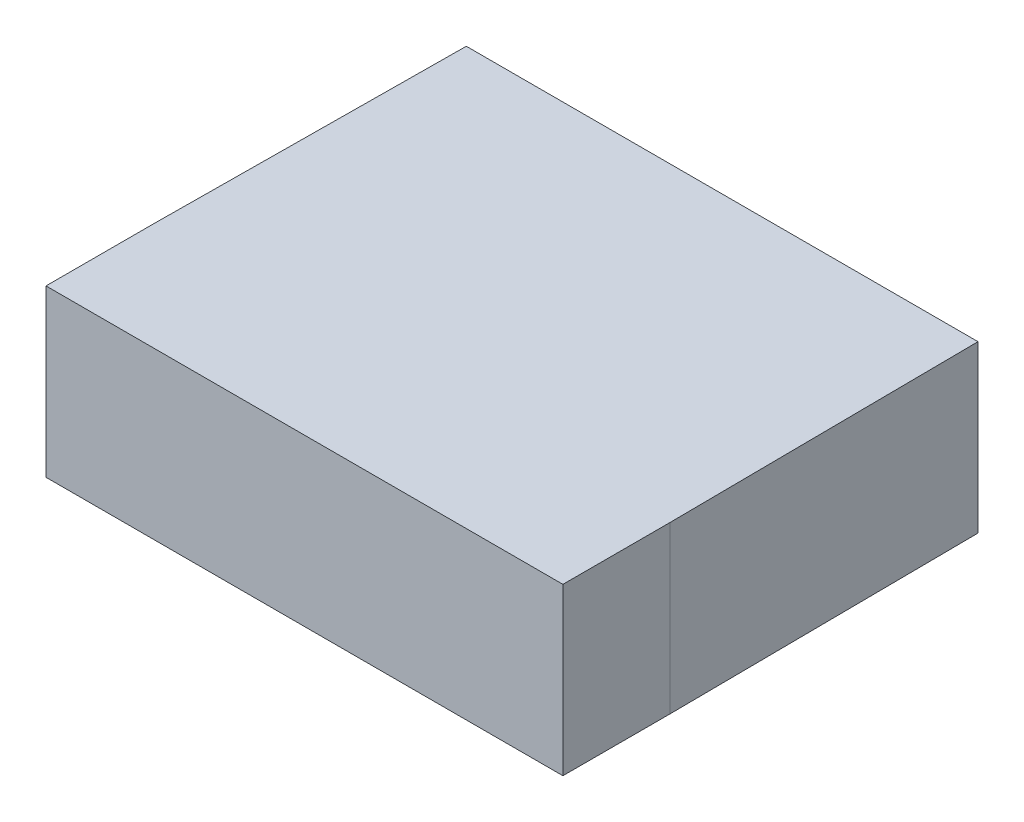
ISO-10303-21;
HEADER;
FILE_DESCRIPTION(('STEP AP214'),'2;1');
FILE_NAME('part.step','',(''),(''),'','','');
FILE_SCHEMA(('AUTOMOTIVE_DESIGN { 1 0 10303 214 1 1 1 1 }'));
ENDSEC;
DATA;
#1=APPLICATION_CONTEXT('core data for automotive mechanical design processes');
#2=APPLICATION_PROTOCOL_DEFINITION('international standard','automotive_design',2000,#1);
#3=PRODUCT_CONTEXT('',#1,'mechanical');
#4=PRODUCT('Part','Part','',(#3));
#5=PRODUCT_RELATED_PRODUCT_CATEGORY('part','',(#4));
#6=PRODUCT_DEFINITION_FORMATION('','',#4);
#7=PRODUCT_DEFINITION_CONTEXT('part definition',#1,'design');
#8=PRODUCT_DEFINITION('design','',#6,#7);
#9=PRODUCT_DEFINITION_SHAPE('','',#8);
#10=(LENGTH_UNIT() NAMED_UNIT(*) SI_UNIT(.MILLI.,.METRE.));
#11=(NAMED_UNIT(*) PLANE_ANGLE_UNIT() SI_UNIT($,.RADIAN.));
#12=(NAMED_UNIT(*) SI_UNIT($,.STERADIAN.) SOLID_ANGLE_UNIT());
#13=UNCERTAINTY_MEASURE_WITH_UNIT(LENGTH_MEASURE(1.E-05),#10,'distance_accuracy_value','');
#14=(GEOMETRIC_REPRESENTATION_CONTEXT(3) GLOBAL_UNCERTAINTY_ASSIGNED_CONTEXT((#13)) GLOBAL_UNIT_ASSIGNED_CONTEXT((#10,
#11,#12)) REPRESENTATION_CONTEXT('',''));
#15=CARTESIAN_POINT('',(0.,0.,0.));
#16=DIRECTION('',(0.,0.,1.));
#17=DIRECTION('',(1.,0.,0.));
#18=AXIS2_PLACEMENT_3D('',#15,#16,#17);
#19=CARTESIAN_POINT('',(-4.95,3.175,5.94999999999999));
#20=DIRECTION('',(0.999964693628953,0.,0.0084030646523441));
#21=DIRECTION('',(0.0084030646523441,0.,-0.999964693628953));
#22=AXIS2_PLACEMENT_3D('',#19,#20,#21);
#23=PLANE('',#22);
#24=DIRECTION('',(-0.0084030646523441,0.,0.999964693628953));
#25=VECTOR('',#24,1.);
#26=CARTESIAN_POINT('',(-4.95,0.,5.94999999999999));
#27=LINE('',#26,#25);
#28=CARTESIAN_POINT('',(-4.9,0.,0.));
#29=VERTEX_POINT('',#28);
#30=CARTESIAN_POINT('',(-4.95,0.,5.94999999999999));
#31=VERTEX_POINT('',#30);
#32=EDGE_CURVE('E118',#29,#31,#27,.T.);
#33=ORIENTED_EDGE('',*,*,#32,.T.);
#34=DIRECTION('',(0.,-1.,0.));
#35=VECTOR('',#34,1.);
#36=CARTESIAN_POINT('',(-4.95,3.175,5.94999999999999));
#37=LINE('',#36,#35);
#38=CARTESIAN_POINT('',(-4.95,3.175,5.94999999999999));
#39=VERTEX_POINT('',#38);
#40=EDGE_CURVE('E11',#39,#31,#37,.T.);
#41=ORIENTED_EDGE('',*,*,#40,.F.);
#42=DIRECTION('',(-0.0084030646523441,0.,0.999964693628953));
#43=VECTOR('',#42,1.);
#44=CARTESIAN_POINT('',(-4.95,3.175,5.94999999999999));
#45=LINE('',#44,#43);
#46=CARTESIAN_POINT('',(-4.9,3.175,0.));
#47=VERTEX_POINT('',#46);
#48=EDGE_CURVE('E128',#47,#39,#45,.T.);
#49=ORIENTED_EDGE('',*,*,#48,.F.);
#50=DIRECTION('',(0.,-1.,0.));
#51=VECTOR('',#50,1.);
#52=CARTESIAN_POINT('',(-4.9,3.175,0.));
#53=LINE('',#52,#51);
#54=EDGE_CURVE('E114',#47,#29,#53,.T.);
#55=ORIENTED_EDGE('',*,*,#54,.T.);
#56=EDGE_LOOP('',(#33,#41,#49,#55));
#57=FACE_BOUND('',#56,.T.);
#58=ADVANCED_FACE('F34',(#57),#23,.F.);
#59=CARTESIAN_POINT('',(-4.95,3.175,7.99999999999999));
#60=DIRECTION('',(0.999999999999999,0.,0.));
#61=DIRECTION('',(0.,0.,-0.999999999999999));
#62=AXIS2_PLACEMENT_3D('',#59,#60,#61);
#63=PLANE('',#62);
#64=DIRECTION('',(0.,0.,0.999999999999999));
#65=VECTOR('',#64,1.);
#66=CARTESIAN_POINT('',(-4.95,0.,7.99999999999999));
#67=LINE('',#66,#65);
#68=CARTESIAN_POINT('',(-4.95,0.,7.99999999999999));
#69=VERTEX_POINT('',#68);
#70=EDGE_CURVE('E121',#31,#69,#67,.T.);
#71=ORIENTED_EDGE('',*,*,#70,.T.);
#72=DIRECTION('',(0.,-1.,0.));
#73=VECTOR('',#72,1.);
#74=CARTESIAN_POINT('',(-4.95,3.175,7.99999999999999));
#75=LINE('',#74,#73);
#76=CARTESIAN_POINT('',(-4.95,3.175,7.99999999999999));
#77=VERTEX_POINT('',#76);
#78=EDGE_CURVE('E42',#77,#69,#75,.T.);
#79=ORIENTED_EDGE('',*,*,#78,.F.);
#80=DIRECTION('',(0.,0.,0.999999999999999));
#81=VECTOR('',#80,1.);
#82=CARTESIAN_POINT('',(-4.95,3.175,7.99999999999999));
#83=LINE('',#82,#81);
#84=EDGE_CURVE('E87',#39,#77,#83,.T.);
#85=ORIENTED_EDGE('',*,*,#84,.F.);
#86=ORIENTED_EDGE('',*,*,#40,.T.);
#87=EDGE_LOOP('',(#71,#79,#85,#86));
#88=FACE_BOUND('',#87,.T.);
#89=ADVANCED_FACE('F152',(#88),#63,.F.);
#90=CARTESIAN_POINT('',(4.94999999999999,3.175,7.99999999999999));
#91=DIRECTION('',(0.,0.,-0.999999999999999));
#92=DIRECTION('',(-0.999999999999999,0.,0.));
#93=AXIS2_PLACEMENT_3D('',#90,#91,#92);
#94=PLANE('',#93);
#95=DIRECTION('',(0.999999999999999,0.,0.));
#96=VECTOR('',#95,1.);
#97=CARTESIAN_POINT('',(4.94999999999999,0.,7.99999999999999));
#98=LINE('',#97,#96);
#99=CARTESIAN_POINT('',(4.94999999999999,0.,7.99999999999999));
#100=VERTEX_POINT('',#99);
#101=EDGE_CURVE('E123',#69,#100,#98,.T.);
#102=ORIENTED_EDGE('',*,*,#101,.T.);
#103=DIRECTION('',(0.,-1.,0.));
#104=VECTOR('',#103,1.);
#105=CARTESIAN_POINT('',(4.94999999999999,3.175,7.99999999999999));
#106=LINE('',#105,#104);
#107=CARTESIAN_POINT('',(4.94999999999999,3.175,7.99999999999999));
#108=VERTEX_POINT('',#107);
#109=EDGE_CURVE('E109',#108,#100,#106,.T.);
#110=ORIENTED_EDGE('',*,*,#109,.F.);
#111=DIRECTION('',(0.999999999999999,0.,0.));
#112=VECTOR('',#111,1.);
#113=CARTESIAN_POINT('',(4.94999999999999,3.175,7.99999999999999));
#114=LINE('',#113,#112);
#115=EDGE_CURVE('E100',#77,#108,#114,.T.);
#116=ORIENTED_EDGE('',*,*,#115,.F.);
#117=ORIENTED_EDGE('',*,*,#78,.T.);
#118=EDGE_LOOP('',(#102,#110,#116,#117));
#119=FACE_BOUND('',#118,.T.);
#120=ADVANCED_FACE('F134',(#119),#94,.F.);
#121=CARTESIAN_POINT('',(4.95,3.175,5.94999999999999));
#122=DIRECTION('',(-0.999999999999999,0.,0.));
#123=DIRECTION('',(0.,0.,0.999999999999999));
#124=AXIS2_PLACEMENT_3D('',#121,#122,#123);
#125=PLANE('',#124);
#126=DIRECTION('',(0.,0.,-0.999999999999999));
#127=VECTOR('',#126,1.);
#128=CARTESIAN_POINT('',(4.95,0.,5.94999999999999));
#129=LINE('',#128,#127);
#130=CARTESIAN_POINT('',(4.95,0.,5.94999999999999));
#131=VERTEX_POINT('',#130);
#132=EDGE_CURVE('E108',#100,#131,#129,.T.);
#133=ORIENTED_EDGE('',*,*,#132,.T.);
#134=DIRECTION('',(0.,-1.,0.));
#135=VECTOR('',#134,1.);
#136=CARTESIAN_POINT('',(4.95,3.175,5.94999999999999));
#137=LINE('',#136,#135);
#138=CARTESIAN_POINT('',(4.95,3.175,5.94999999999999));
#139=VERTEX_POINT('',#138);
#140=EDGE_CURVE('E105',#139,#131,#137,.T.);
#141=ORIENTED_EDGE('',*,*,#140,.F.);
#142=DIRECTION('',(0.,0.,-0.999999999999999));
#143=VECTOR('',#142,1.);
#144=CARTESIAN_POINT('',(4.95,3.175,5.94999999999999));
#145=LINE('',#144,#143);
#146=EDGE_CURVE('E94',#108,#139,#145,.T.);
#147=ORIENTED_EDGE('',*,*,#146,.F.);
#148=ORIENTED_EDGE('',*,*,#109,.T.);
#149=EDGE_LOOP('',(#133,#141,#147,#148));
#150=FACE_BOUND('',#149,.T.);
#151=ADVANCED_FACE('F106',(#150),#125,.F.);
#152=CARTESIAN_POINT('',(4.9,3.175,0.));
#153=DIRECTION('',(-0.999964693628953,0.,0.0084030646523441));
#154=DIRECTION('',(0.0084030646523441,0.,0.999964693628953));
#155=AXIS2_PLACEMENT_3D('',#152,#153,#154);
#156=PLANE('',#155);
#157=DIRECTION('',(-0.0084030646523441,0.,-0.999964693628953));
#158=VECTOR('',#157,1.);
#159=CARTESIAN_POINT('',(4.9,0.,0.));
#160=LINE('',#159,#158);
#161=CARTESIAN_POINT('',(4.9,0.,0.));
#162=VERTEX_POINT('',#161);
#163=EDGE_CURVE('E73',#131,#162,#160,.T.);
#164=ORIENTED_EDGE('',*,*,#163,.T.);
#165=DIRECTION('',(0.,-1.,0.));
#166=VECTOR('',#165,1.);
#167=CARTESIAN_POINT('',(4.9,3.175,0.));
#168=LINE('',#167,#166);
#169=CARTESIAN_POINT('',(4.9,3.175,0.));
#170=VERTEX_POINT('',#169);
#171=EDGE_CURVE('E110',#170,#162,#168,.T.);
#172=ORIENTED_EDGE('',*,*,#171,.F.);
#173=DIRECTION('',(-0.0084030646523441,0.,-0.999964693628953));
#174=VECTOR('',#173,1.);
#175=CARTESIAN_POINT('',(4.9,3.175,0.));
#176=LINE('',#175,#174);
#177=EDGE_CURVE('E98',#139,#170,#176,.T.);
#178=ORIENTED_EDGE('',*,*,#177,.F.);
#179=ORIENTED_EDGE('',*,*,#140,.T.);
#180=EDGE_LOOP('',(#164,#172,#178,#179));
#181=FACE_BOUND('',#180,.T.);
#182=ADVANCED_FACE('F112',(#181),#156,.F.);
#183=CARTESIAN_POINT('',(-4.9,3.175,0.));
#184=DIRECTION('',(0.,0.,0.999999999999999));
#185=DIRECTION('',(0.999999999999999,0.,0.));
#186=AXIS2_PLACEMENT_3D('',#183,#184,#185);
#187=PLANE('',#186);
#188=DIRECTION('',(-0.999999999999999,0.,0.));
#189=VECTOR('',#188,1.);
#190=CARTESIAN_POINT('',(-4.9,0.,0.));
#191=LINE('',#190,#189);
#192=EDGE_CURVE('E79',#162,#29,#191,.T.);
#193=ORIENTED_EDGE('',*,*,#192,.T.);
#194=ORIENTED_EDGE('',*,*,#54,.F.);
#195=DIRECTION('',(-0.999999999999999,0.,0.));
#196=VECTOR('',#195,1.);
#197=CARTESIAN_POINT('',(-4.9,3.175,0.));
#198=LINE('',#197,#196);
#199=EDGE_CURVE('E50',#170,#47,#198,.T.);
#200=ORIENTED_EDGE('',*,*,#199,.F.);
#201=ORIENTED_EDGE('',*,*,#171,.T.);
#202=EDGE_LOOP('',(#193,#194,#200,#201));
#203=FACE_BOUND('',#202,.T.);
#204=ADVANCED_FACE('F141',(#203),#187,.F.);
#205=CARTESIAN_POINT('',(0.,3.175,0.));
#206=DIRECTION('',(0.,-1.,0.));
#207=DIRECTION('',(0.,0.,-0.999999999999999));
#208=AXIS2_PLACEMENT_3D('',#205,#206,#207);
#209=PLANE('',#208);
#210=ORIENTED_EDGE('',*,*,#48,.T.);
#211=ORIENTED_EDGE('',*,*,#84,.T.);
#212=ORIENTED_EDGE('',*,*,#115,.T.);
#213=ORIENTED_EDGE('',*,*,#146,.T.);
#214=ORIENTED_EDGE('',*,*,#177,.T.);
#215=ORIENTED_EDGE('',*,*,#199,.T.);
#216=EDGE_LOOP('',(#210,#211,#212,#213,#214,#215));
#217=FACE_BOUND('',#216,.T.);
#218=ADVANCED_FACE('F96',(#217),#209,.F.);
#219=CARTESIAN_POINT('',(0.,0.,0.));
#220=DIRECTION('',(0.,-1.,0.));
#221=DIRECTION('',(0.,0.,-0.999999999999999));
#222=AXIS2_PLACEMENT_3D('',#219,#220,#221);
#223=PLANE('',#222);
#224=ORIENTED_EDGE('',*,*,#32,.F.);
#225=ORIENTED_EDGE('',*,*,#192,.F.);
#226=ORIENTED_EDGE('',*,*,#163,.F.);
#227=ORIENTED_EDGE('',*,*,#132,.F.);
#228=ORIENTED_EDGE('',*,*,#101,.F.);
#229=ORIENTED_EDGE('',*,*,#70,.F.);
#230=EDGE_LOOP('',(#224,#225,#226,#227,#228,#229));
#231=FACE_BOUND('',#230,.T.);
#232=ADVANCED_FACE('F137',(#231),#223,.T.);
#233=CLOSED_SHELL('',(#58,#89,#120,#151,#182,#204,#218,#232));
#234=MANIFOLD_SOLID_BREP('B2',#233);
#235=ADVANCED_BREP_SHAPE_REPRESENTATION('',(#18,#234),#14);
#236=SHAPE_DEFINITION_REPRESENTATION(#9,#235);
ENDSEC;
END-ISO-10303-21;
